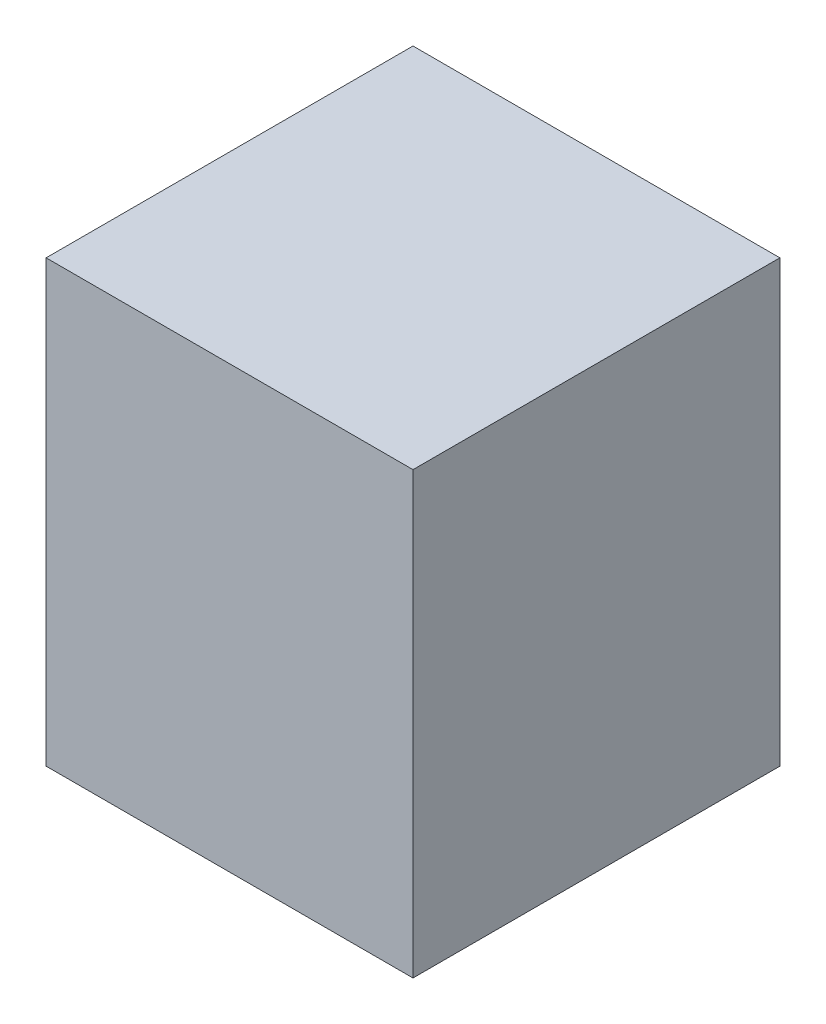
ISO-10303-21;
HEADER;
FILE_DESCRIPTION(('STEP AP214'),'2;1');
FILE_NAME('part.step','',(''),(''),'','','');
FILE_SCHEMA(('AUTOMOTIVE_DESIGN { 1 0 10303 214 1 1 1 1 }'));
ENDSEC;
DATA;
#1=APPLICATION_CONTEXT('core data for automotive mechanical design processes');
#2=APPLICATION_PROTOCOL_DEFINITION('international standard','automotive_design',2000,#1);
#3=PRODUCT_CONTEXT('',#1,'mechanical');
#4=PRODUCT('Part','Part','',(#3));
#5=PRODUCT_RELATED_PRODUCT_CATEGORY('part','',(#4));
#6=PRODUCT_DEFINITION_FORMATION('','',#4);
#7=PRODUCT_DEFINITION_CONTEXT('part definition',#1,'design');
#8=PRODUCT_DEFINITION('design','',#6,#7);
#9=PRODUCT_DEFINITION_SHAPE('','',#8);
#10=(LENGTH_UNIT() NAMED_UNIT(*) SI_UNIT(.MILLI.,.METRE.));
#11=(NAMED_UNIT(*) PLANE_ANGLE_UNIT() SI_UNIT($,.RADIAN.));
#12=(NAMED_UNIT(*) SI_UNIT($,.STERADIAN.) SOLID_ANGLE_UNIT());
#13=UNCERTAINTY_MEASURE_WITH_UNIT(LENGTH_MEASURE(1.E-05),#10,'distance_accuracy_value','');
#14=(GEOMETRIC_REPRESENTATION_CONTEXT(3) GLOBAL_UNCERTAINTY_ASSIGNED_CONTEXT((#13)) GLOBAL_UNIT_ASSIGNED_CONTEXT((#10,
#11,#12)) REPRESENTATION_CONTEXT('',''));
#15=CARTESIAN_POINT('',(0.,0.,0.));
#16=DIRECTION('',(0.,0.,1.));
#17=DIRECTION('',(1.,0.,0.));
#18=AXIS2_PLACEMENT_3D('',#15,#16,#17);
#19=CARTESIAN_POINT('',(-25.,30.,-25.));
#20=DIRECTION('',(1.,0.,0.));
#21=DIRECTION('',(0.,0.,-1.));
#22=AXIS2_PLACEMENT_3D('',#19,#20,#21);
#23=PLANE('',#22);
#24=DIRECTION('',(0.,0.,1.));
#25=VECTOR('',#24,1.);
#26=CARTESIAN_POINT('',(-25.,-30.,-25.));
#27=LINE('',#26,#25);
#28=CARTESIAN_POINT('',(-25.,-30.,-25.));
#29=VERTEX_POINT('',#28);
#30=CARTESIAN_POINT('',(-25.,-30.,25.));
#31=VERTEX_POINT('',#30);
#32=EDGE_CURVE('E113',#29,#31,#27,.T.);
#33=ORIENTED_EDGE('',*,*,#32,.T.);
#34=DIRECTION('',(0.,-1.,0.));
#35=VECTOR('',#34,1.);
#36=CARTESIAN_POINT('',(-25.,30.,25.));
#37=LINE('',#36,#35);
#38=CARTESIAN_POINT('',(-25.,30.,25.));
#39=VERTEX_POINT('',#38);
#40=EDGE_CURVE('E11',#39,#31,#37,.T.);
#41=ORIENTED_EDGE('',*,*,#40,.F.);
#42=DIRECTION('',(0.,0.,1.));
#43=VECTOR('',#42,1.);
#44=CARTESIAN_POINT('',(-25.,30.,-25.));
#45=LINE('',#44,#43);
#46=CARTESIAN_POINT('',(-25.,30.,-25.));
#47=VERTEX_POINT('',#46);
#48=EDGE_CURVE('E97',#47,#39,#45,.T.);
#49=ORIENTED_EDGE('',*,*,#48,.F.);
#50=DIRECTION('',(0.,-1.,0.));
#51=VECTOR('',#50,1.);
#52=CARTESIAN_POINT('',(-25.,30.,-25.));
#53=LINE('',#52,#51);
#54=EDGE_CURVE('E109',#47,#29,#53,.T.);
#55=ORIENTED_EDGE('',*,*,#54,.T.);
#56=EDGE_LOOP('',(#33,#41,#49,#55));
#57=FACE_BOUND('',#56,.T.);
#58=ADVANCED_FACE('F45',(#57),#23,.F.);
#59=CARTESIAN_POINT('',(-25.,30.,25.));
#60=DIRECTION('',(0.,0.,-1.));
#61=DIRECTION('',(-1.,0.,0.));
#62=AXIS2_PLACEMENT_3D('',#59,#60,#61);
#63=PLANE('',#62);
#64=DIRECTION('',(1.,0.,0.));
#65=VECTOR('',#64,1.);
#66=CARTESIAN_POINT('',(-25.,-30.,25.));
#67=LINE('',#66,#65);
#68=CARTESIAN_POINT('',(25.,-30.,25.));
#69=VERTEX_POINT('',#68);
#70=EDGE_CURVE('E102',#31,#69,#67,.T.);
#71=ORIENTED_EDGE('',*,*,#70,.T.);
#72=DIRECTION('',(0.,-1.,0.));
#73=VECTOR('',#72,1.);
#74=CARTESIAN_POINT('',(25.,30.,25.));
#75=LINE('',#74,#73);
#76=CARTESIAN_POINT('',(25.,30.,25.));
#77=VERTEX_POINT('',#76);
#78=EDGE_CURVE('E54',#77,#69,#75,.T.);
#79=ORIENTED_EDGE('',*,*,#78,.F.);
#80=DIRECTION('',(1.,0.,0.));
#81=VECTOR('',#80,1.);
#82=CARTESIAN_POINT('',(-25.,30.,25.));
#83=LINE('',#82,#81);
#84=EDGE_CURVE('E92',#39,#77,#83,.T.);
#85=ORIENTED_EDGE('',*,*,#84,.F.);
#86=ORIENTED_EDGE('',*,*,#40,.T.);
#87=EDGE_LOOP('',(#71,#79,#85,#86));
#88=FACE_BOUND('',#87,.T.);
#89=ADVANCED_FACE('F101',(#88),#63,.F.);
#90=CARTESIAN_POINT('',(25.,30.,-25.));
#91=DIRECTION('',(-1.,0.,0.));
#92=DIRECTION('',(0.,0.,1.));
#93=AXIS2_PLACEMENT_3D('',#90,#91,#92);
#94=PLANE('',#93);
#95=DIRECTION('',(0.,0.,-1.));
#96=VECTOR('',#95,1.);
#97=CARTESIAN_POINT('',(25.,-30.,-25.));
#98=LINE('',#97,#96);
#99=CARTESIAN_POINT('',(25.,-30.,-25.));
#100=VERTEX_POINT('',#99);
#101=EDGE_CURVE('E79',#69,#100,#98,.T.);
#102=ORIENTED_EDGE('',*,*,#101,.T.);
#103=DIRECTION('',(0.,-1.,0.));
#104=VECTOR('',#103,1.);
#105=CARTESIAN_POINT('',(25.,30.,-25.));
#106=LINE('',#105,#104);
#107=CARTESIAN_POINT('',(25.,30.,-25.));
#108=VERTEX_POINT('',#107);
#109=EDGE_CURVE('E104',#108,#100,#106,.T.);
#110=ORIENTED_EDGE('',*,*,#109,.F.);
#111=DIRECTION('',(0.,0.,-1.));
#112=VECTOR('',#111,1.);
#113=CARTESIAN_POINT('',(25.,30.,-25.));
#114=LINE('',#113,#112);
#115=EDGE_CURVE('E95',#77,#108,#114,.T.);
#116=ORIENTED_EDGE('',*,*,#115,.F.);
#117=ORIENTED_EDGE('',*,*,#78,.T.);
#118=EDGE_LOOP('',(#102,#110,#116,#117));
#119=FACE_BOUND('',#118,.T.);
#120=ADVANCED_FACE('F105',(#119),#94,.F.);
#121=CARTESIAN_POINT('',(-25.,30.,-25.));
#122=DIRECTION('',(0.,0.,1.));
#123=DIRECTION('',(1.,0.,0.));
#124=AXIS2_PLACEMENT_3D('',#121,#122,#123);
#125=PLANE('',#124);
#126=DIRECTION('',(-1.,0.,0.));
#127=VECTOR('',#126,1.);
#128=CARTESIAN_POINT('',(-25.,-30.,-25.));
#129=LINE('',#128,#127);
#130=EDGE_CURVE('E85',#100,#29,#129,.T.);
#131=ORIENTED_EDGE('',*,*,#130,.T.);
#132=ORIENTED_EDGE('',*,*,#54,.F.);
#133=DIRECTION('',(-1.,0.,0.));
#134=VECTOR('',#133,1.);
#135=CARTESIAN_POINT('',(-25.,30.,-25.));
#136=LINE('',#135,#134);
#137=EDGE_CURVE('E62',#108,#47,#136,.T.);
#138=ORIENTED_EDGE('',*,*,#137,.F.);
#139=ORIENTED_EDGE('',*,*,#109,.T.);
#140=EDGE_LOOP('',(#131,#132,#138,#139));
#141=FACE_BOUND('',#140,.T.);
#142=ADVANCED_FACE('F126',(#141),#125,.F.);
#143=CARTESIAN_POINT('',(0.,30.,0.));
#144=DIRECTION('',(0.,1.,0.));
#145=DIRECTION('',(0.,0.,1.));
#146=AXIS2_PLACEMENT_3D('',#143,#144,#145);
#147=PLANE('',#146);
#148=ORIENTED_EDGE('',*,*,#48,.T.);
#149=ORIENTED_EDGE('',*,*,#84,.T.);
#150=ORIENTED_EDGE('',*,*,#115,.T.);
#151=ORIENTED_EDGE('',*,*,#137,.T.);
#152=EDGE_LOOP('',(#148,#149,#150,#151));
#153=FACE_BOUND('',#152,.T.);
#154=ADVANCED_FACE('F93',(#153),#147,.T.);
#155=CARTESIAN_POINT('',(0.,-30.,0.));
#156=DIRECTION('',(0.,1.,0.));
#157=DIRECTION('',(0.,0.,1.));
#158=AXIS2_PLACEMENT_3D('',#155,#156,#157);
#159=PLANE('',#158);
#160=ORIENTED_EDGE('',*,*,#32,.F.);
#161=ORIENTED_EDGE('',*,*,#130,.F.);
#162=ORIENTED_EDGE('',*,*,#101,.F.);
#163=ORIENTED_EDGE('',*,*,#70,.F.);
#164=EDGE_LOOP('',(#160,#161,#162,#163));
#165=FACE_BOUND('',#164,.T.);
#166=ADVANCED_FACE('F129',(#165),#159,.F.);
#167=CLOSED_SHELL('',(#58,#89,#120,#142,#154,#166));
#168=MANIFOLD_SOLID_BREP('B2',#167);
#169=ADVANCED_BREP_SHAPE_REPRESENTATION('',(#18,#168),#14);
#170=SHAPE_DEFINITION_REPRESENTATION(#9,#169);
ENDSEC;
END-ISO-10303-21;
